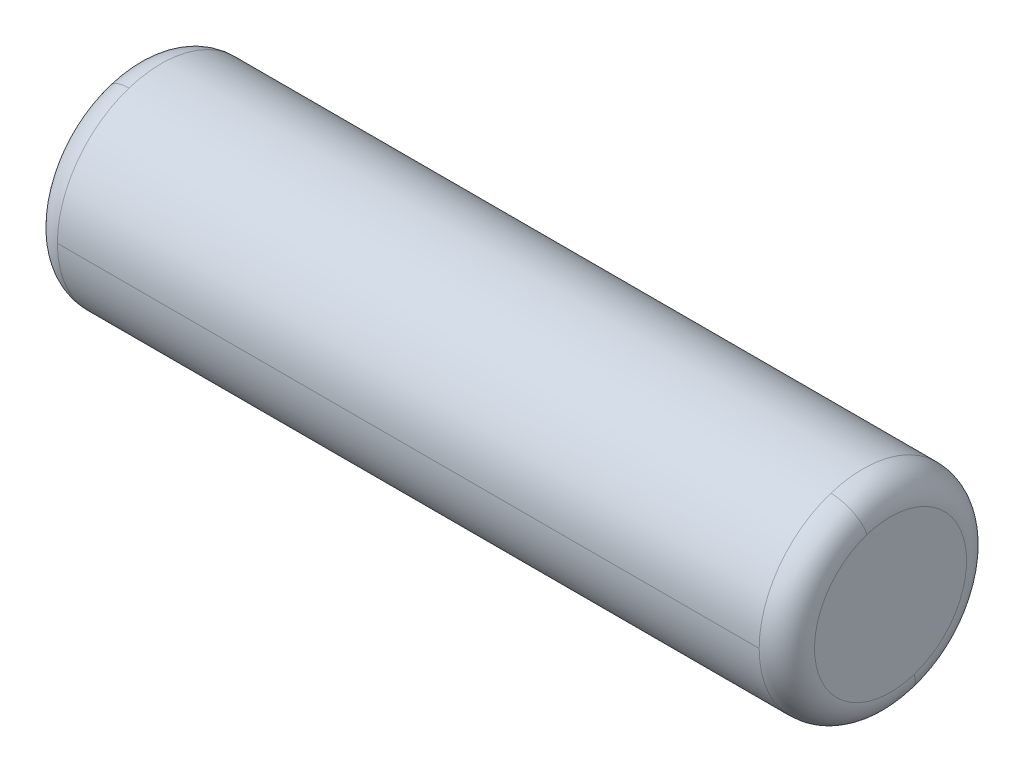
ISO-10303-21;
HEADER;
FILE_DESCRIPTION(('STEP AP214'),'2;1');
FILE_NAME('part.step','',(''),(''),'','','');
FILE_SCHEMA(('AUTOMOTIVE_DESIGN { 1 0 10303 214 1 1 1 1 }'));
ENDSEC;
DATA;
#1=APPLICATION_CONTEXT('core data for automotive mechanical design processes');
#2=APPLICATION_PROTOCOL_DEFINITION('international standard','automotive_design',2000,#1);
#3=PRODUCT_CONTEXT('',#1,'mechanical');
#4=PRODUCT('Part','Part','',(#3));
#5=PRODUCT_RELATED_PRODUCT_CATEGORY('part','',(#4));
#6=PRODUCT_DEFINITION_FORMATION('','',#4);
#7=PRODUCT_DEFINITION_CONTEXT('part definition',#1,'design');
#8=PRODUCT_DEFINITION('design','',#6,#7);
#9=PRODUCT_DEFINITION_SHAPE('','',#8);
#10=(LENGTH_UNIT() NAMED_UNIT(*) SI_UNIT(.MILLI.,.METRE.));
#11=(NAMED_UNIT(*) PLANE_ANGLE_UNIT() SI_UNIT($,.RADIAN.));
#12=(NAMED_UNIT(*) SI_UNIT($,.STERADIAN.) SOLID_ANGLE_UNIT());
#13=UNCERTAINTY_MEASURE_WITH_UNIT(LENGTH_MEASURE(1.E-05),#10,'distance_accuracy_value','');
#14=(GEOMETRIC_REPRESENTATION_CONTEXT(3) GLOBAL_UNCERTAINTY_ASSIGNED_CONTEXT((#13)) GLOBAL_UNIT_ASSIGNED_CONTEXT((#10,
#11,#12)) REPRESENTATION_CONTEXT('',''));
#15=CARTESIAN_POINT('',(0.,0.,0.));
#16=DIRECTION('',(0.,0.,1.));
#17=DIRECTION('',(1.,0.,0.));
#18=AXIS2_PLACEMENT_3D('',#15,#16,#17);
#19=CARTESIAN_POINT('',(2.35,8.,0.));
#20=DIRECTION('',(1.,0.,0.));
#21=DIRECTION('',(0.,0.,-1.));
#22=AXIS2_PLACEMENT_3D('',#19,#20,#21);
#23=PLANE('',#22);
#24=CARTESIAN_POINT('',(2.35,8.69744144528296,0.226612462541579));
#25=CARTESIAN_POINT('',(2.35,8.69373374586507,0.238024411682907));
#26=CARTESIAN_POINT('',(2.35,8.6897454884511,0.249345179232635));
#27=CARTESIAN_POINT('',(2.35,8.68121851156343,0.271777475978529));
#28=CARTESIAN_POINT('',(2.35,8.67667979208974,0.282889005174697));
#29=CARTESIAN_POINT('',(2.35,8.6670625450151,0.304875950043115));
#30=CARTESIAN_POINT('',(2.35,8.66198401741415,0.315751365715366));
#31=CARTESIAN_POINT('',(2.35,8.65129946379298,0.337239912249846));
#32=CARTESIAN_POINT('',(2.35,8.64569343777276,0.347853043112075));
#33=CARTESIAN_POINT('',(2.35,8.6339673726004,0.368791444416637));
#34=CARTESIAN_POINT('',(2.35,8.62784733344826,0.37911671485897));
#35=CARTESIAN_POINT('',(2.35,8.61510799111368,0.399454522892141));
#36=CARTESIAN_POINT('',(2.35,8.60848868793123,0.409467060482979));
#37=CARTESIAN_POINT('',(2.35,8.5947667625726,0.429155281184004));
#38=CARTESIAN_POINT('',(2.35,8.58766414039641,0.438830964294191));
#39=CARTESIAN_POINT('',(2.35,8.57299268827631,0.457822166612945));
#40=CARTESIAN_POINT('',(2.35,8.5654238583324,0.467137685821512));
#41=CARTESIAN_POINT('',(2.35,8.54983822454741,0.485386118395884));
#42=CARTESIAN_POINT('',(2.35,8.54182142070634,0.49431903176169));
#43=CARTESIAN_POINT('',(2.35,8.52535915233747,0.511780732490374));
#44=CARTESIAN_POINT('',(2.35,8.51691368780968,0.520309519853254));
#45=CARTESIAN_POINT('',(2.35,8.4996144439237,0.536942421977464));
#46=CARTESIAN_POINT('',(2.35,8.49076066456552,0.545046536738796));
#47=CARTESIAN_POINT('',(2.35,8.47266612055073,0.560810570138373));
#48=CARTESIAN_POINT('',(2.35,8.46342535589413,0.568470488776618));
#49=CARTESIAN_POINT('',(2.35,8.44457910309343,0.583327676514891));
#50=CARTESIAN_POINT('',(2.35,8.43497361494933,0.590524945614918));
#51=CARTESIAN_POINT('',(2.35,8.41542105563604,0.60443949542514));
#52=CARTESIAN_POINT('',(2.35,8.40547398446686,0.611156776135335));
#53=CARTESIAN_POINT('',(2.35,8.3852622224691,0.624095166648283));
#54=CARTESIAN_POINT('',(2.35,8.37499753164051,0.630316276451037));
#55=CARTESIAN_POINT('',(2.35,8.35417525886322,0.642247337950685));
#56=CARTESIAN_POINT('',(2.35,8.34361767691453,0.64795728964758));
#57=CARTESIAN_POINT('',(2.35,8.32223505603667,0.658852279161742));
#58=CARTESIAN_POINT('',(2.35,8.3114100171075,0.664037316979008));
#59=CARTESIAN_POINT('',(2.35,8.28951856073565,0.673869987523654));
#60=CARTESIAN_POINT('',(2.35,8.27845214329297,0.678517620251034));
#61=CARTESIAN_POINT('',(2.35,8.256104589863,0.687264284061582));
#62=CARTESIAN_POINT('',(2.35,8.24482345387572,0.69136331514475));
#63=CARTESIAN_POINT('',(2.35,8.22207364060126,0.699002900741963));
#64=CARTESIAN_POINT('',(2.35,8.21060496331408,0.702543455256008));
#65=CARTESIAN_POINT('',(2.35,8.18750769648795,0.709057558209035));
#66=CARTESIAN_POINT('',(2.35,8.175879106949,0.712031106648016));
#67=CARTESIAN_POINT('',(2.35,8.15249002991007,0.717404033912273));
#68=CARTESIAN_POINT('',(2.35,8.14072954241009,0.719803412737549));
#69=CARTESIAN_POINT('',(2.35,8.11710500149358,0.724022220460645));
#70=CARTESIAN_POINT('',(2.35,8.10524094807706,0.725841649358465));
#71=CARTESIAN_POINT('',(2.35,8.08143785687131,0.728896174063071));
#72=CARTESIAN_POINT('',(2.35,8.06949881908209,0.730131269869857));
#73=CARTESIAN_POINT('',(2.35,8.04557452131872,0.732014152938414));
#74=CARTESIAN_POINT('',(2.35,8.03358926134458,0.732661940200186));
#75=CARTESIAN_POINT('',(2.35,8.00960139275243,0.733368645602461));
#76=CARTESIAN_POINT('',(2.35,7.99759878413442,0.733427563742966));
#77=CARTESIAN_POINT('',(2.35,7.97360513359,0.732956388963745));
#78=CARTESIAN_POINT('',(2.35,7.9616140916636,0.732426296044021));
#79=CARTESIAN_POINT('',(2.35,7.93767246197268,0.730778376184618));
#80=CARTESIAN_POINT('',(2.35,7.92572187420817,0.72966054924494));
#81=CARTESIAN_POINT('',(2.35,7.90188994285371,0.726839854288637));
#82=CARTESIAN_POINT('',(2.35,7.89000859926377,0.725136986272012));
#83=CARTESIAN_POINT('',(2.35,7.86634377945583,0.721150311520021));
#84=CARTESIAN_POINT('',(2.35,7.85456030323785,0.718866504784656));
#85=CARTESIAN_POINT('',(2.35,7.83111960560015,0.713723454485647));
#86=CARTESIAN_POINT('',(2.35,7.81946238418044,0.710864210922004));
#87=CARTESIAN_POINT('',(2.35,7.79630227940675,0.704577175134626));
#88=CARTESIAN_POINT('',(2.35,7.78479939605277,0.70114938291089));
#89=CARTESIAN_POINT('',(2.35,7.76197567886407,0.693733507655033));
#90=CARTESIAN_POINT('',(2.35,7.75065484502936,0.689745424622912));
#91=CARTESIAN_POINT('',(2.35,7.72822249975948,0.681218575391621));
#92=CARTESIAN_POINT('',(2.35,7.71711098832432,0.676679809192452));
#93=CARTESIAN_POINT('',(2.35,7.69512405645787,0.66706252791239));
#94=CARTESIAN_POINT('',(2.35,7.68424863602657,0.661984012831497));
#95=CARTESIAN_POINT('',(2.35,7.66276008600822,0.651299468375642));
#96=CARTESIAN_POINT('',(2.35,7.65214695642118,0.64569343900068));
#97=CARTESIAN_POINT('',(2.35,7.63120855605011,0.63396737137248));
#98=CARTESIAN_POINT('',(2.35,7.6208832852661,0.627847333119244));
#99=CARTESIAN_POINT('',(2.35,7.60054547698279,0.615107991442699));
#100=CARTESIAN_POINT('',(2.35,7.59053293948351,0.608488688019392));
#101=CARTESIAN_POINT('',(2.35,7.57084471884951,0.594766762484436));
#102=CARTESIAN_POINT('',(2.35,7.56116903571479,0.587664140372787));
#103=CARTESIAN_POINT('',(2.35,7.54217783337808,0.572992688299932));
#104=CARTESIAN_POINT('',(2.35,7.53286231417608,0.565423858338725));
#105=CARTESIAN_POINT('',(2.35,7.51461388160652,0.549838224541081));
#106=CARTESIAN_POINT('',(2.35,7.50568096823896,0.541821420704644));
#107=CARTESIAN_POINT('',(2.35,7.48821926750898,0.52535915233917));
#108=CARTESIAN_POINT('',(2.35,7.47969048014657,0.516913687810134));
#109=CARTESIAN_POINT('',(2.35,7.46305757802271,0.499614443923248));
#110=CARTESIAN_POINT('',(2.35,7.45495346326125,0.490760664565397));
#111=CARTESIAN_POINT('',(2.35,7.43918942986158,0.472666120550857));
#112=CARTESIAN_POINT('',(2.35,7.43152951122337,0.463425355894166));
#113=CARTESIAN_POINT('',(2.35,7.41667232348512,0.444579103093397));
#114=CARTESIAN_POINT('',(2.35,7.40947505438509,0.434973614949318));
#115=CARTESIAN_POINT('',(2.35,7.39556050457486,0.415421055636054));
#116=CARTESIAN_POINT('',(2.35,7.38884322386466,0.405473984466868));
#117=CARTESIAN_POINT('',(2.35,7.37590483335172,0.385262222469097));
#118=CARTESIAN_POINT('',(2.35,7.36968372354896,0.374997531640512));
#119=CARTESIAN_POINT('',(2.35,7.35775266204932,0.354175258863227));
#120=CARTESIAN_POINT('',(2.35,7.35204271035242,0.343617676914528));
#121=CARTESIAN_POINT('',(2.35,7.34114772083826,0.322235056036667));
#122=CARTESIAN_POINT('',(2.35,7.33596268302099,0.311410017107504));
#123=CARTESIAN_POINT('',(2.35,7.32613001247635,0.289518560735656));
#124=CARTESIAN_POINT('',(2.35,7.32148237974896,0.27845214329297));
#125=CARTESIAN_POINT('',(2.35,7.31273571593842,0.256104589863003));
#126=CARTESIAN_POINT('',(2.35,7.30863668485526,0.244823453875721));
#127=CARTESIAN_POINT('',(2.35,7.30099709925803,0.222073640601254));
#128=CARTESIAN_POINT('',(2.35,7.29745654474396,0.210604963314069));
#129=CARTESIAN_POINT('',(2.35,7.290942441791,0.187507696487958));
#130=CARTESIAN_POINT('',(2.35,7.28796889335211,0.175879106949032));
#131=CARTESIAN_POINT('',(2.35,7.2825959660876,0.152490029910033));
#132=CARTESIAN_POINT('',(2.35,7.28019658726198,0.140729542409959));
#133=CARTESIAN_POINT('',(2.35,7.27597777953982,0.117105001493709));
#134=CARTESIAN_POINT('',(2.35,7.27415835064329,0.105240948077533));
#135=CARTESIAN_POINT('',(2.35,7.27110382593518,0.0814378568708378));
#136=CARTESIAN_POINT('',(2.35,7.26986873012361,0.0694988190803187));
#137=CARTESIAN_POINT('',(2.35,7.26798584706812,0.0455745213205006));
#138=CARTESIAN_POINT('',(2.35,7.2673380598242,0.0335892613512017));
#139=CARTESIAN_POINT('',(2.35,7.26663135437315,0.00960139274580662));
#140=CARTESIAN_POINT('',(2.35,7.26657243616601,-0.00240121589028959));
#141=CARTESIAN_POINT('',(2.35,7.26704361112728,-0.026394866385287));
#142=CARTESIAN_POINT('',(2.35,7.26757370429567,-0.0383859082441882));
#143=CARTESIAN_POINT('',(2.35,7.26922162347569,-0.0623275381195325));
#144=CARTESIAN_POINT('',(2.35,7.27033944948731,-0.0742781261359757));
#145=CARTESIAN_POINT('',(2.35,7.27316014697912,-0.0981100568021429));
#146=CARTESIAN_POINT('',(2.35,7.27486301845932,-0.109991399451867));
#147=CARTESIAN_POINT('',(2.35,7.27884968374865,-0.13365622182853));
#148=CARTESIAN_POINT('',(2.35,7.28113347755778,-0.145439701555469));
#149=CARTESIAN_POINT('',(2.35,7.28627656317192,-0.168880389606531));
#150=CARTESIAN_POINT('',(2.35,7.28913585497692,-0.180537597930652));
#151=CARTESIAN_POINT('',(2.35,7.29542275896644,-0.203697738482153));
#152=CARTESIAN_POINT('',(2.35,7.29885037115096,-0.215200670709532));
#153=CARTESIAN_POINT('',(2.35,7.30255855471704,-0.226612462541576));
#154=B_SPLINE_CURVE_WITH_KNOTS('',3,(#24,#25,#26,#27,#28,#29,#30,#31,#32,#33,#34,#35,#36,#37,
#38,#39,#40,#41,#42,#43,#44,#45,#46,#47,#48,#49,#50,#51,#52,#53,#54,#55,#56,#57,#58,#59,#60,#61,
#62,#63,#64,#65,#66,#67,#68,#69,#70,#71,#72,#73,#74,#75,#76,#77,#78,#79,#80,#81,#82,#83,#84,#85,
#86,#87,#88,#89,#90,#91,#92,#93,#94,#95,#96,#97,#98,#99,#100,#101,#102,#103,#104,#105,#106,#107,
#108,#109,#110,#111,#112,#113,#114,#115,#116,#117,#118,#119,#120,#121,#122,#123,#124,#125,#126,
#127,#128,#129,#130,#131,#132,#133,#134,#135,#136,#137,#138,#139,#140,#141,#142,#143,#144,#145,
#146,#147,#148,#149,#150,#151,#152,#153),.UNSPECIFIED.,.F.,.F.,(4,2,2,2,2,2,2,2,2,2,2,2,2,2,2,2,
2,2,2,2,2,2,2,2,2,2,2,2,2,2,2,2,2,2,2,2,2,2,2,2,2,2,2,2,2,2,2,2,2,2,2,2,2,2,2,2,2,2,2,2,2,2,2,2,
4),(0.,0.0359938018335968,0.0719876036671936,0.107981405500791,0.143975207334387,
0.179969009167985,0.215962811001581,0.251956612835178,0.287950414668774,0.323944216502372,
0.359938018335968,0.395931820169565,0.431925622003162,0.467919423836759,0.503913225670357,
0.539907027503953,0.57590082933755,0.611894631171146,0.647888433004743,0.683882234838341,
0.719876036671937,0.755869838505534,0.79186364033913,0.827857442172728,0.863851244006325,
0.899845045839922,0.935838847673518,0.971832649507114,1.00782645134071,1.04382025317431,
1.07981405500791,1.1158078568415,1.1518016586751,1.1877954605087,1.22378926234229,
1.25978306417589,1.29577686600949,1.33177066784308,1.36776446967668,1.40375827151028,
1.43975207334387,1.47574587517747,1.51173967701107,1.54773347884467,1.58372728067826,
1.61972108251186,1.65571488434545,1.69170868617905,1.72770248801265,1.76369628984625,
1.79969009167984,1.83568389351344,1.87167769534704,1.90767149718063,1.94366529901423,
1.97965910084783,2.01565290268142,2.05164670451502,2.08764050634862,2.12363430818221,
2.15962811001581,2.19562191184941,2.231615713683,2.2676095155166,2.3036033173502),.UNSPECIFIED.);
#155=CARTESIAN_POINT('',(2.35,8.69744144528296,0.226612462541579));
#156=VERTEX_POINT('',#155);
#157=CARTESIAN_POINT('',(2.35,7.30255855471704,-0.226612462541579));
#158=VERTEX_POINT('',#157);
#159=EDGE_CURVE('E11',#156,#158,#154,.T.);
#160=ORIENTED_EDGE('',*,*,#159,.F.);
#161=CARTESIAN_POINT('',(2.35,7.30255855471704,-0.226612462541579));
#162=CARTESIAN_POINT('',(2.35,7.30626625413493,-0.238024411682907));
#163=CARTESIAN_POINT('',(2.35,7.3102545115489,-0.249345179232634));
#164=CARTESIAN_POINT('',(2.35,7.31878148843657,-0.271777475978529));
#165=CARTESIAN_POINT('',(2.35,7.32332020791026,-0.282889005174697));
#166=CARTESIAN_POINT('',(2.35,7.3329374549849,-0.304875950043115));
#167=CARTESIAN_POINT('',(2.35,7.33801598258585,-0.315751365715366));
#168=CARTESIAN_POINT('',(2.35,7.34870053620702,-0.337239912249845));
#169=CARTESIAN_POINT('',(2.35,7.35430656222724,-0.347853043112074));
#170=CARTESIAN_POINT('',(2.35,7.3660326273996,-0.368791444416637));
#171=CARTESIAN_POINT('',(2.35,7.37215266655174,-0.37911671485897));
#172=CARTESIAN_POINT('',(2.35,7.38489200888632,-0.399454522892141));
#173=CARTESIAN_POINT('',(2.35,7.39151131206877,-0.409467060482979));
#174=CARTESIAN_POINT('',(2.35,7.4052332374274,-0.429155281184004));
#175=CARTESIAN_POINT('',(2.35,7.41233585960359,-0.438830964294191));
#176=CARTESIAN_POINT('',(2.35,7.42700731172369,-0.457822166612945));
#177=CARTESIAN_POINT('',(2.35,7.43457614166761,-0.467137685821511));
#178=CARTESIAN_POINT('',(2.35,7.45016177545259,-0.485386118395884));
#179=CARTESIAN_POINT('',(2.35,7.45817857929366,-0.49431903176169));
#180=CARTESIAN_POINT('',(2.35,7.47464084766253,-0.511780732490374));
#181=CARTESIAN_POINT('',(2.35,7.48308631219032,-0.520309519853254));
#182=CARTESIAN_POINT('',(2.35,7.5003855560763,-0.536942421977464));
#183=CARTESIAN_POINT('',(2.35,7.50923933543448,-0.545046536738796));
#184=CARTESIAN_POINT('',(2.35,7.52733387944927,-0.560810570138372));
#185=CARTESIAN_POINT('',(2.35,7.53657464410587,-0.568470488776618));
#186=CARTESIAN_POINT('',(2.35,7.55542089690657,-0.583327676514891));
#187=CARTESIAN_POINT('',(2.35,7.56502638505067,-0.590524945614918));
#188=CARTESIAN_POINT('',(2.35,7.58457894436396,-0.60443949542514));
#189=CARTESIAN_POINT('',(2.35,7.59452601553313,-0.611156776135335));
#190=CARTESIAN_POINT('',(2.35,7.6147377775309,-0.624095166648283));
#191=CARTESIAN_POINT('',(2.35,7.62500246835949,-0.630316276451036));
#192=CARTESIAN_POINT('',(2.35,7.64582474113677,-0.642247337950685));
#193=CARTESIAN_POINT('',(2.35,7.65638232308547,-0.64795728964758));
#194=CARTESIAN_POINT('',(2.35,7.67776494396333,-0.658852279161742));
#195=CARTESIAN_POINT('',(2.35,7.6885899828925,-0.664037316979008));
#196=CARTESIAN_POINT('',(2.35,7.71048143926435,-0.673869987523654));
#197=CARTESIAN_POINT('',(2.35,7.72154785670703,-0.678517620251034));
#198=CARTESIAN_POINT('',(2.35,7.743895410137,-0.687264284061582));
#199=CARTESIAN_POINT('',(2.35,7.75517654612428,-0.69136331514475));
#200=CARTESIAN_POINT('',(2.35,7.77792635939874,-0.699002900741963));
#201=CARTESIAN_POINT('',(2.35,7.78939503668592,-0.702543455256008));
#202=CARTESIAN_POINT('',(2.35,7.81249230351205,-0.709057558209034));
#203=CARTESIAN_POINT('',(2.35,7.824120893051,-0.712031106648016));
#204=CARTESIAN_POINT('',(2.35,7.84750997008993,-0.717404033912273));
#205=CARTESIAN_POINT('',(2.35,7.85927045758991,-0.719803412737549));
#206=CARTESIAN_POINT('',(2.35,7.88289499850642,-0.724022220460645));
#207=CARTESIAN_POINT('',(2.35,7.89475905192294,-0.725841649358465));
#208=CARTESIAN_POINT('',(2.35,7.91856214312869,-0.728896174063071));
#209=CARTESIAN_POINT('',(2.35,7.93050118091791,-0.730131269869856));
#210=CARTESIAN_POINT('',(2.35,7.95442547868127,-0.732014152938414));
#211=CARTESIAN_POINT('',(2.35,7.96641073865542,-0.732661940200185));
#212=CARTESIAN_POINT('',(2.35,7.99039860724757,-0.733368645602461));
#213=CARTESIAN_POINT('',(2.35,8.00240121586558,-0.733427563742965));
#214=CARTESIAN_POINT('',(2.35,8.02639486641,-0.732956388963745));
#215=CARTESIAN_POINT('',(2.35,8.0383859083364,-0.732426296044021));
#216=CARTESIAN_POINT('',(2.35,8.06232753802732,-0.730778376184618));
#217=CARTESIAN_POINT('',(2.35,8.07427812579183,-0.72966054924494));
#218=CARTESIAN_POINT('',(2.35,8.09811005714629,-0.726839854288637));
#219=CARTESIAN_POINT('',(2.35,8.10999140073623,-0.725136986272012));
#220=CARTESIAN_POINT('',(2.35,8.13365622054417,-0.721150311520021));
#221=CARTESIAN_POINT('',(2.35,8.14543969676215,-0.718866504784656));
#222=CARTESIAN_POINT('',(2.35,8.16888039439985,-0.713723454485647));
#223=CARTESIAN_POINT('',(2.35,8.18053761581956,-0.710864210922004));
#224=CARTESIAN_POINT('',(2.35,8.20369772059325,-0.704577175134626));
#225=CARTESIAN_POINT('',(2.35,8.21520060394723,-0.701149382910891));
#226=CARTESIAN_POINT('',(2.35,8.23802432113592,-0.693733507655033));
#227=CARTESIAN_POINT('',(2.35,8.24934515497064,-0.689745424622912));
#228=CARTESIAN_POINT('',(2.35,8.27177750024052,-0.681218575391621));
#229=CARTESIAN_POINT('',(2.35,8.28288901167568,-0.676679809192452));
#230=CARTESIAN_POINT('',(2.35,8.30487594354213,-0.66706252791239));
#231=CARTESIAN_POINT('',(2.35,8.31575136397343,-0.661984012831497));
#232=CARTESIAN_POINT('',(2.35,8.33723991399178,-0.651299468375642));
#233=CARTESIAN_POINT('',(2.35,8.34785304357882,-0.64569343900068));
#234=CARTESIAN_POINT('',(2.35,8.36879144394989,-0.63396737137248));
#235=CARTESIAN_POINT('',(2.35,8.3791167147339,-0.627847333119244));
#236=CARTESIAN_POINT('',(2.35,8.39945452301721,-0.615107991442699));
#237=CARTESIAN_POINT('',(2.35,8.40946706051649,-0.608488688019392));
#238=CARTESIAN_POINT('',(2.35,8.42915528115049,-0.594766762484436));
#239=CARTESIAN_POINT('',(2.35,8.43883096428521,-0.587664140372787));
#240=CARTESIAN_POINT('',(2.35,8.45782216662192,-0.572992688299932));
#241=CARTESIAN_POINT('',(2.35,8.46713768582392,-0.565423858338725));
#242=CARTESIAN_POINT('',(2.35,8.48538611839348,-0.549838224541081));
#243=CARTESIAN_POINT('',(2.35,8.49431903176104,-0.541821420704644));
#244=CARTESIAN_POINT('',(2.35,8.51178073249102,-0.525359152339171));
#245=CARTESIAN_POINT('',(2.35,8.52030951985342,-0.516913687810134));
#246=CARTESIAN_POINT('',(2.35,8.53694242197729,-0.499614443923248));
#247=CARTESIAN_POINT('',(2.35,8.54504653673875,-0.490760664565398));
#248=CARTESIAN_POINT('',(2.35,8.56081057013842,-0.472666120550858));
#249=CARTESIAN_POINT('',(2.35,8.56847048877663,-0.463425355894167));
#250=CARTESIAN_POINT('',(2.35,8.58332767651488,-0.444579103093397));
#251=CARTESIAN_POINT('',(2.35,8.59052494561491,-0.434973614949319));
#252=CARTESIAN_POINT('',(2.35,8.60443949542514,-0.415421055636055));
#253=CARTESIAN_POINT('',(2.35,8.61115677613533,-0.405473984466869));
#254=CARTESIAN_POINT('',(2.35,8.62409516664828,-0.385262222469098));
#255=CARTESIAN_POINT('',(2.35,8.63031627645104,-0.374997531640513));
#256=CARTESIAN_POINT('',(2.35,8.64224733795068,-0.354175258863228));
#257=CARTESIAN_POINT('',(2.35,8.64795728964758,-0.343617676914529));
#258=CARTESIAN_POINT('',(2.35,8.65885227916174,-0.322235056036667));
#259=CARTESIAN_POINT('',(2.35,8.66403731697901,-0.311410017107504));
#260=CARTESIAN_POINT('',(2.35,8.67386998752365,-0.289518560735657));
#261=CARTESIAN_POINT('',(2.35,8.67851762025103,-0.278452143292971));
#262=CARTESIAN_POINT('',(2.35,8.68726428406158,-0.256104589863004));
#263=CARTESIAN_POINT('',(2.35,8.69136331514474,-0.244823453875722));
#264=CARTESIAN_POINT('',(2.35,8.69900290074197,-0.222073640601255));
#265=CARTESIAN_POINT('',(2.35,8.70254345525604,-0.21060496331407));
#266=CARTESIAN_POINT('',(2.35,8.709057558209,-0.187507696487959));
#267=CARTESIAN_POINT('',(2.35,8.71203110664789,-0.175879106949033));
#268=CARTESIAN_POINT('',(2.35,8.7174040339124,-0.152490029910034));
#269=CARTESIAN_POINT('',(2.35,8.71980341273802,-0.14072954240996));
#270=CARTESIAN_POINT('',(2.35,8.72402222046017,-0.117105001493711));
#271=CARTESIAN_POINT('',(2.35,8.72584164935671,-0.105240948077534));
#272=CARTESIAN_POINT('',(2.35,8.72889617406482,-0.0814378568708387));
#273=CARTESIAN_POINT('',(2.35,8.73013126987639,-0.0694988190803198));
#274=CARTESIAN_POINT('',(2.35,8.73201415293188,-0.045574521320502));
#275=CARTESIAN_POINT('',(2.35,8.7326619401758,-0.0335892613512031));
#276=CARTESIAN_POINT('',(2.35,8.73336864562685,-0.00960139274580803));
#277=CARTESIAN_POINT('',(2.35,8.73342756383399,0.00240121589028817));
#278=CARTESIAN_POINT('',(2.35,8.73295638887272,0.0263948663852856));
#279=CARTESIAN_POINT('',(2.35,8.73242629570433,0.0383859082441868));
#280=CARTESIAN_POINT('',(2.35,8.73077837652431,0.0623275381195311));
#281=CARTESIAN_POINT('',(2.35,8.72966055051269,0.0742781261359743));
#282=CARTESIAN_POINT('',(2.35,8.72683985302088,0.0981100568021416));
#283=CARTESIAN_POINT('',(2.35,8.72513698154068,0.109991399451866));
#284=CARTESIAN_POINT('',(2.35,8.72115031625135,0.133656221828529));
#285=CARTESIAN_POINT('',(2.35,8.71886652244222,0.145439701555469));
#286=CARTESIAN_POINT('',(2.35,8.71372343682808,0.16888038960653));
#287=CARTESIAN_POINT('',(2.35,8.71086414502308,0.180537597930652));
#288=CARTESIAN_POINT('',(2.35,8.70457724103356,0.203697738482152));
#289=CARTESIAN_POINT('',(2.35,8.70114962884904,0.215200670709531));
#290=CARTESIAN_POINT('',(2.35,8.69744144528296,0.226612462541575));
#291=B_SPLINE_CURVE_WITH_KNOTS('',3,(#161,#162,#163,#164,#165,#166,#167,#168,#169,#170,#171,
#172,#173,#174,#175,#176,#177,#178,#179,#180,#181,#182,#183,#184,#185,#186,#187,#188,#189,#190,
#191,#192,#193,#194,#195,#196,#197,#198,#199,#200,#201,#202,#203,#204,#205,#206,#207,#208,#209,
#210,#211,#212,#213,#214,#215,#216,#217,#218,#219,#220,#221,#222,#223,#224,#225,#226,#227,#228,
#229,#230,#231,#232,#233,#234,#235,#236,#237,#238,#239,#240,#241,#242,#243,#244,#245,#246,#247,
#248,#249,#250,#251,#252,#253,#254,#255,#256,#257,#258,#259,#260,#261,#262,#263,#264,#265,#266,
#267,#268,#269,#270,#271,#272,#273,#274,#275,#276,#277,#278,#279,#280,#281,#282,#283,#284,#285,
#286,#287,#288,#289,#290),.UNSPECIFIED.,.F.,.F.,(4,2,2,2,2,2,2,2,2,2,2,2,2,2,2,2,2,2,2,2,2,2,2,
2,2,2,2,2,2,2,2,2,2,2,2,2,2,2,2,2,2,2,2,2,2,2,2,2,2,2,2,2,2,2,2,2,2,2,2,2,2,2,2,2,4),(0.,
0.0359938018335969,0.0719876036671935,0.10798140550079,0.143975207334387,0.179969009167984,
0.215962811001581,0.251956612835178,0.287950414668775,0.323944216502372,0.359938018335968,
0.395931820169565,0.431925622003162,0.467919423836759,0.503913225670355,0.539907027503952,
0.57590082933755,0.611894631171147,0.647888433004743,0.68388223483834,0.719876036671937,
0.755869838505533,0.79186364033913,0.827857442172728,0.863851244006323,0.89984504583992,
0.935838847673518,0.971832649507114,1.00782645134071,1.04382025317431,1.0798140550079,
1.1158078568415,1.1518016586751,1.18779546050869,1.22378926234229,1.25978306417589,
1.29577686600949,1.33177066784308,1.36776446967668,1.40375827151028,1.43975207334387,
1.47574587517747,1.51173967701107,1.54773347884466,1.58372728067826,1.61972108251186,
1.65571488434545,1.69170868617905,1.72770248801265,1.76369628984624,1.79969009167984,
1.83568389351344,1.87167769534703,1.90767149718063,1.94366529901423,1.97965910084782,
2.01565290268142,2.05164670451502,2.08764050634861,2.12363430818221,2.15962811001581,
2.19562191184941,2.231615713683,2.2676095155166,2.3036033173502),.UNSPECIFIED.);
#292=EDGE_CURVE('E26',#158,#156,#291,.T.);
#293=ORIENTED_EDGE('',*,*,#292,.F.);
#294=EDGE_LOOP('',(#160,#293));
#295=FACE_BOUND('',#294,.T.);
#296=ADVANCED_FACE('F17',(#295),#23,.F.);
#297=CARTESIAN_POINT('',(2.61666666666683,8.,0.));
#298=DIRECTION('',(1.,0.,0.));
#299=DIRECTION('',(0.,-0.309016994374947,0.951056516295154));
#300=AXIS2_PLACEMENT_3D('',#297,#298,#299);
#301=TOROIDAL_SURFACE('',#300,0.733333333333175,0.266666666666826);
#302=CARTESIAN_POINT('',(2.61666666666683,7.30255855471704,-0.226612462541579));
#303=DIRECTION('',(0.,0.309016994374947,-0.951056516295154));
#304=DIRECTION('',(-4.72955008490034E-13,-0.951056516295154,-0.309016994374947));
#305=AXIS2_PLACEMENT_3D('',#302,#303,#304);
#306=CIRCLE('',#305,0.266666666666826);
#307=CARTESIAN_POINT('',(2.6166666666667,7.04894348370485,-0.309016994374947));
#308=VERTEX_POINT('',#307);
#309=EDGE_CURVE('E139',#308,#158,#306,.T.);
#310=ORIENTED_EDGE('',*,*,#309,.T.);
#311=ORIENTED_EDGE('',*,*,#292,.T.);
#312=CARTESIAN_POINT('',(2.61666666666683,8.69744144528296,0.226612462541579));
#313=DIRECTION('',(0.,-0.309016994374948,0.951056516295153));
#314=DIRECTION('',(-4.71289673953099E-13,0.951056516295153,0.309016994374948));
#315=AXIS2_PLACEMENT_3D('',#312,#313,#314);
#316=CIRCLE('',#315,0.266666666666825);
#317=CARTESIAN_POINT('',(2.6166666666667,8.95105651629515,0.309016994374948));
#318=VERTEX_POINT('',#317);
#319=EDGE_CURVE('E135',#318,#156,#316,.T.);
#320=ORIENTED_EDGE('',*,*,#319,.F.);
#321=CARTESIAN_POINT('',(2.6166666666667,8.,0.));
#322=DIRECTION('',(1.,0.,0.));
#323=DIRECTION('',(0.,0.,-1.));
#324=AXIS2_PLACEMENT_3D('',#321,#322,#323);
#325=CIRCLE('',#324,1.);
#326=CARTESIAN_POINT('',(2.6166666666667,8.,-1.));
#327=VERTEX_POINT('',#326);
#328=EDGE_CURVE('E130',#327,#318,#325,.T.);
#329=ORIENTED_EDGE('',*,*,#328,.F.);
#330=CARTESIAN_POINT('',(2.6166666666667,8.,0.));
#331=DIRECTION('',(1.,0.,0.));
#332=DIRECTION('',(0.,0.,-1.));
#333=AXIS2_PLACEMENT_3D('',#330,#331,#332);
#334=CIRCLE('',#333,1.);
#335=EDGE_CURVE('E125',#308,#327,#334,.T.);
#336=ORIENTED_EDGE('',*,*,#335,.F.);
#337=EDGE_LOOP('',(#310,#311,#320,#329,#336));
#338=FACE_BOUND('',#337,.T.);
#339=ADVANCED_FACE('F146',(#338),#301,.T.);
#340=CARTESIAN_POINT('',(9.65,8.,0.));
#341=DIRECTION('',(1.,0.,0.));
#342=DIRECTION('',(0.,1.,0.));
#343=AXIS2_PLACEMENT_3D('',#340,#341,#342);
#344=CYLINDRICAL_SURFACE('',#343,1.);
#345=DIRECTION('',(1.,0.,0.));
#346=VECTOR('',#345,1.);
#347=CARTESIAN_POINT('',(2.6166666666667,8.,1.));
#348=LINE('',#347,#346);
#349=CARTESIAN_POINT('',(2.6166666666667,8.,1.));
#350=VERTEX_POINT('',#349);
#351=CARTESIAN_POINT('',(9.3833333333333,8.,1.));
#352=VERTEX_POINT('',#351);
#353=EDGE_CURVE('E92',#350,#352,#348,.T.);
#354=ORIENTED_EDGE('',*,*,#353,.F.);
#355=CARTESIAN_POINT('',(2.6166666666667,8.,0.));
#356=DIRECTION('',(1.,0.,0.));
#357=DIRECTION('',(0.,0.,-1.));
#358=AXIS2_PLACEMENT_3D('',#355,#356,#357);
#359=CIRCLE('',#358,1.);
#360=EDGE_CURVE('E117',#350,#308,#359,.T.);
#361=ORIENTED_EDGE('',*,*,#360,.T.);
#362=ORIENTED_EDGE('',*,*,#335,.T.);
#363=DIRECTION('',(1.,0.,0.));
#364=VECTOR('',#363,1.);
#365=CARTESIAN_POINT('',(2.6166666666667,8.,-1.));
#366=LINE('',#365,#364);
#367=CARTESIAN_POINT('',(9.3833333333333,8.,-1.));
#368=VERTEX_POINT('',#367);
#369=EDGE_CURVE('E113',#327,#368,#366,.T.);
#370=ORIENTED_EDGE('',*,*,#369,.T.);
#371=CARTESIAN_POINT('',(9.3833333333333,8.,0.));
#372=DIRECTION('',(1.,0.,0.));
#373=DIRECTION('',(0.,0.,-1.));
#374=AXIS2_PLACEMENT_3D('',#371,#372,#373);
#375=CIRCLE('',#374,1.);
#376=CARTESIAN_POINT('',(9.3833333333333,7.04894348370485,-0.309016994374948));
#377=VERTEX_POINT('',#376);
#378=EDGE_CURVE('E84',#377,#368,#375,.T.);
#379=ORIENTED_EDGE('',*,*,#378,.F.);
#380=CARTESIAN_POINT('',(9.3833333333333,8.,0.));
#381=DIRECTION('',(1.,0.,0.));
#382=DIRECTION('',(0.,0.,-1.));
#383=AXIS2_PLACEMENT_3D('',#380,#381,#382);
#384=CIRCLE('',#383,1.);
#385=EDGE_CURVE('E106',#352,#377,#384,.T.);
#386=ORIENTED_EDGE('',*,*,#385,.F.);
#387=EDGE_LOOP('',(#354,#361,#362,#370,#379,#386));
#388=FACE_BOUND('',#387,.T.);
#389=ADVANCED_FACE('F155',(#388),#344,.T.);
#390=CARTESIAN_POINT('',(9.38333333333317,8.,0.));
#391=DIRECTION('',(1.,0.,0.));
#392=DIRECTION('',(0.,0.309016994374947,-0.951056516295154));
#393=AXIS2_PLACEMENT_3D('',#390,#391,#392);
#394=TOROIDAL_SURFACE('',#393,0.733333333333173,0.266666666666828);
#395=CARTESIAN_POINT('',(9.38333333333317,7.30255855471704,-0.226612462541578));
#396=DIRECTION('',(0.,0.309016994374947,-0.951056516295154));
#397=DIRECTION('',(1.,0.,0.));
#398=AXIS2_PLACEMENT_3D('',#395,#396,#397);
#399=CIRCLE('',#398,0.266666666666827);
#400=CARTESIAN_POINT('',(9.65,7.30255855471704,-0.226612462541579));
#401=VERTEX_POINT('',#400);
#402=EDGE_CURVE('E102',#401,#377,#399,.T.);
#403=ORIENTED_EDGE('',*,*,#402,.F.);
#404=CARTESIAN_POINT('',(9.65,8.,0.));
#405=DIRECTION('',(1.,0.,0.));
#406=DIRECTION('',(0.,0.,-1.));
#407=AXIS2_PLACEMENT_3D('',#404,#405,#406);
#408=CIRCLE('',#407,0.733333333333301);
#409=CARTESIAN_POINT('',(9.65,8.69744144528296,0.226612462541579));
#410=VERTEX_POINT('',#409);
#411=EDGE_CURVE('E74',#410,#401,#408,.T.);
#412=ORIENTED_EDGE('',*,*,#411,.F.);
#413=CARTESIAN_POINT('',(9.38333333333317,8.69744144528296,0.226612462541578));
#414=DIRECTION('',(0.,-0.309016994374947,0.951056516295154));
#415=DIRECTION('',(1.,0.,0.));
#416=AXIS2_PLACEMENT_3D('',#413,#414,#415);
#417=CIRCLE('',#416,0.266666666666827);
#418=CARTESIAN_POINT('',(9.3833333333333,8.95105651629515,0.309016994374948));
#419=VERTEX_POINT('',#418);
#420=EDGE_CURVE('E67',#410,#419,#417,.T.);
#421=ORIENTED_EDGE('',*,*,#420,.T.);
#422=CARTESIAN_POINT('',(9.3833333333333,8.,0.));
#423=DIRECTION('',(1.,0.,0.));
#424=DIRECTION('',(0.,0.,-1.));
#425=AXIS2_PLACEMENT_3D('',#422,#423,#424);
#426=CIRCLE('',#425,1.);
#427=EDGE_CURVE('E72',#419,#352,#426,.T.);
#428=ORIENTED_EDGE('',*,*,#427,.T.);
#429=ORIENTED_EDGE('',*,*,#385,.T.);
#430=EDGE_LOOP('',(#403,#412,#421,#428,#429));
#431=FACE_BOUND('',#430,.T.);
#432=ADVANCED_FACE('F69',(#431),#394,.T.);
#433=CARTESIAN_POINT('',(9.65,8.,0.));
#434=DIRECTION('',(1.,0.,0.));
#435=DIRECTION('',(0.,-1.,0.));
#436=AXIS2_PLACEMENT_3D('',#433,#434,#435);
#437=CYLINDRICAL_SURFACE('',#436,1.);
#438=ORIENTED_EDGE('',*,*,#353,.T.);
#439=ORIENTED_EDGE('',*,*,#427,.F.);
#440=CARTESIAN_POINT('',(9.3833333333333,8.,0.));
#441=DIRECTION('',(1.,0.,0.));
#442=DIRECTION('',(0.,0.,-1.));
#443=AXIS2_PLACEMENT_3D('',#440,#441,#442);
#444=CIRCLE('',#443,1.);
#445=EDGE_CURVE('E81',#368,#419,#444,.T.);
#446=ORIENTED_EDGE('',*,*,#445,.F.);
#447=ORIENTED_EDGE('',*,*,#369,.F.);
#448=ORIENTED_EDGE('',*,*,#328,.T.);
#449=CARTESIAN_POINT('',(2.6166666666667,8.,0.));
#450=DIRECTION('',(1.,0.,0.));
#451=DIRECTION('',(0.,0.,-1.));
#452=AXIS2_PLACEMENT_3D('',#449,#450,#451);
#453=CIRCLE('',#452,1.);
#454=EDGE_CURVE('E87',#318,#350,#453,.T.);
#455=ORIENTED_EDGE('',*,*,#454,.T.);
#456=EDGE_LOOP('',(#438,#439,#446,#447,#448,#455));
#457=FACE_BOUND('',#456,.T.);
#458=ADVANCED_FACE('F90',(#457),#437,.T.);
#459=CARTESIAN_POINT('',(2.61666666666683,8.,0.));
#460=DIRECTION('',(1.,0.,0.));
#461=DIRECTION('',(0.,0.309016994374947,-0.951056516295154));
#462=AXIS2_PLACEMENT_3D('',#459,#460,#461);
#463=TOROIDAL_SURFACE('',#462,0.733333333333175,0.266666666666826);
#464=ORIENTED_EDGE('',*,*,#309,.F.);
#465=ORIENTED_EDGE('',*,*,#360,.F.);
#466=ORIENTED_EDGE('',*,*,#454,.F.);
#467=ORIENTED_EDGE('',*,*,#319,.T.);
#468=ORIENTED_EDGE('',*,*,#159,.T.);
#469=EDGE_LOOP('',(#464,#465,#466,#467,#468));
#470=FACE_BOUND('',#469,.T.);
#471=ADVANCED_FACE('F164',(#470),#463,.T.);
#472=CARTESIAN_POINT('',(9.38333333333317,8.,0.));
#473=DIRECTION('',(1.,0.,0.));
#474=DIRECTION('',(0.,-0.309016994374947,0.951056516295154));
#475=AXIS2_PLACEMENT_3D('',#472,#473,#474);
#476=TOROIDAL_SURFACE('',#475,0.733333333333173,0.266666666666828);
#477=ORIENTED_EDGE('',*,*,#402,.T.);
#478=ORIENTED_EDGE('',*,*,#378,.T.);
#479=ORIENTED_EDGE('',*,*,#445,.T.);
#480=ORIENTED_EDGE('',*,*,#420,.F.);
#481=CARTESIAN_POINT('',(9.65,7.30255855471692,-0.226612462541618));
#482=CARTESIAN_POINT('',(9.65,7.37381768910431,-0.445622721072562));
#483=CARTESIAN_POINT('',(9.65,7.53069780879612,-0.637275857189457));
#484=CARTESIAN_POINT('',(9.65,7.76041545463908,-0.754024787079431));
#485=CARTESIAN_POINT('',(9.65,8.25450088851628,-0.783273194783016));
#486=CARTESIAN_POINT('',(9.65,8.63703261849484,-0.469194604486865));
#487=CARTESIAN_POINT('',(9.65,8.75425479867935,-0.239718091712948));
#488=CARTESIAN_POINT('',(9.65,8.76852259462449,0.00754437316359918));
#489=CARTESIAN_POINT('',(9.65,8.69744144528308,0.226612462541617));
#490=B_SPLINE_CURVE_WITH_KNOTS('',5,(#481,#482,#483,#484,#485,#486,#487,#488,#489),
.UNSPECIFIED.,.F.,.F.,(6,3,6),(0.,1.5707963267949,3.14159265358979),.UNSPECIFIED.);
#491=EDGE_CURVE('E185',#401,#410,#490,.T.);
#492=ORIENTED_EDGE('',*,*,#491,.F.);
#493=EDGE_LOOP('',(#477,#478,#479,#480,#492));
#494=FACE_BOUND('',#493,.T.);
#495=ADVANCED_FACE('F83',(#494),#476,.T.);
#496=CARTESIAN_POINT('',(9.65,8.7333333333333,0.));
#497=DIRECTION('',(-1.,0.,0.));
#498=DIRECTION('',(0.,0.,1.));
#499=AXIS2_PLACEMENT_3D('',#496,#497,#498);
#500=PLANE('',#499);
#501=ORIENTED_EDGE('',*,*,#491,.T.);
#502=ORIENTED_EDGE('',*,*,#411,.T.);
#503=EDGE_LOOP('',(#501,#502));
#504=FACE_BOUND('',#503,.T.);
#505=ADVANCED_FACE('F191',(#504),#500,.F.);
#506=CLOSED_SHELL('',(#296,#339,#389,#432,#458,#471,#495,#505));
#507=MANIFOLD_SOLID_BREP('B1',#506);
#508=ADVANCED_BREP_SHAPE_REPRESENTATION('',(#18,#507),#14);
#509=SHAPE_DEFINITION_REPRESENTATION(#9,#508);
ENDSEC;
END-ISO-10303-21;
